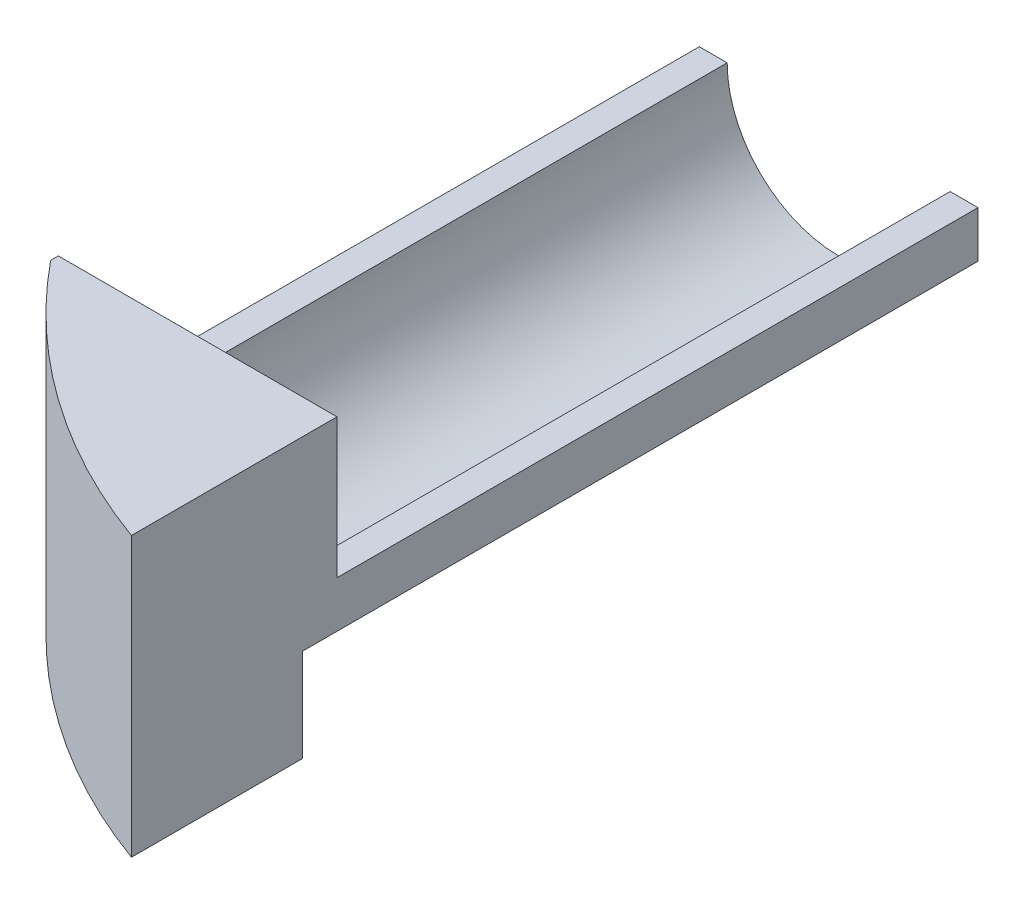
ISO-10303-21;
HEADER;
FILE_DESCRIPTION(('STEP AP214'),'2;1');
FILE_NAME('part.step','',(''),(''),'','','');
FILE_SCHEMA(('AUTOMOTIVE_DESIGN { 1 0 10303 214 1 1 1 1 }'));
ENDSEC;
DATA;
#1=APPLICATION_CONTEXT('core data for automotive mechanical design processes');
#2=APPLICATION_PROTOCOL_DEFINITION('international standard','automotive_design',2000,#1);
#3=PRODUCT_CONTEXT('',#1,'mechanical');
#4=PRODUCT('Part','Part','',(#3));
#5=PRODUCT_RELATED_PRODUCT_CATEGORY('part','',(#4));
#6=PRODUCT_DEFINITION_FORMATION('','',#4);
#7=PRODUCT_DEFINITION_CONTEXT('part definition',#1,'design');
#8=PRODUCT_DEFINITION('design','',#6,#7);
#9=PRODUCT_DEFINITION_SHAPE('','',#8);
#10=(LENGTH_UNIT() NAMED_UNIT(*) SI_UNIT(.MILLI.,.METRE.));
#11=(NAMED_UNIT(*) PLANE_ANGLE_UNIT() SI_UNIT($,.RADIAN.));
#12=(NAMED_UNIT(*) SI_UNIT($,.STERADIAN.) SOLID_ANGLE_UNIT());
#13=UNCERTAINTY_MEASURE_WITH_UNIT(LENGTH_MEASURE(1.E-05),#10,'distance_accuracy_value','');
#14=(GEOMETRIC_REPRESENTATION_CONTEXT(3) GLOBAL_UNCERTAINTY_ASSIGNED_CONTEXT((#13)) GLOBAL_UNIT_ASSIGNED_CONTEXT((#10,
#11,#12)) REPRESENTATION_CONTEXT('',''));
#15=CARTESIAN_POINT('',(0.,0.,0.));
#16=DIRECTION('',(0.,0.,1.));
#17=DIRECTION('',(1.,0.,0.));
#18=AXIS2_PLACEMENT_3D('',#15,#16,#17);
#19=CARTESIAN_POINT('',(-30.,30.,100.));
#20=DIRECTION('',(0.,-1.,0.));
#21=DIRECTION('',(0.,0.,-1.));
#22=AXIS2_PLACEMENT_3D('',#19,#20,#21);
#23=PLANE('',#22);
#24=DIRECTION('',(1.,0.,0.));
#25=VECTOR('',#24,1.);
#26=CARTESIAN_POINT('',(0.,30.,69.));
#27=LINE('',#26,#25);
#28=CARTESIAN_POINT('',(-30.,30.,69.));
#29=VERTEX_POINT('',#28);
#30=CARTESIAN_POINT('',(0.,30.,69.));
#31=VERTEX_POINT('',#30);
#32=EDGE_CURVE('E151',#29,#31,#27,.T.);
#33=ORIENTED_EDGE('',*,*,#32,.F.);
#34=DIRECTION('',(0.,0.,-1.));
#35=VECTOR('',#34,1.);
#36=CARTESIAN_POINT('',(-30.,30.,100.));
#37=LINE('',#36,#35);
#38=CARTESIAN_POINT('',(-30.,30.,69.8246485929605));
#39=VERTEX_POINT('',#38);
#40=EDGE_CURVE('E48',#39,#29,#37,.T.);
#41=ORIENTED_EDGE('',*,*,#40,.F.);
#42=CARTESIAN_POINT('',(23.5,30.,26.25));
#43=DIRECTION('',(0.,-1.,0.));
#44=DIRECTION('',(1.,0.,0.));
#45=AXIS2_PLACEMENT_3D('',#42,#43,#44);
#46=CIRCLE('',#45,69.);
#47=CARTESIAN_POINT('',(0.,30.,91.1248795759961));
#48=VERTEX_POINT('',#47);
#49=EDGE_CURVE('E174',#48,#39,#46,.T.);
#50=ORIENTED_EDGE('',*,*,#49,.F.);
#51=DIRECTION('',(0.,0.,-1.));
#52=VECTOR('',#51,1.);
#53=CARTESIAN_POINT('',(0.,30.,100.));
#54=LINE('',#53,#52);
#55=EDGE_CURVE('E12',#48,#31,#54,.T.);
#56=ORIENTED_EDGE('',*,*,#55,.T.);
#57=EDGE_LOOP('',(#33,#41,#50,#56));
#58=FACE_BOUND('',#57,.T.);
#59=ADVANCED_FACE('F40',(#58),#23,.F.);
#60=CARTESIAN_POINT('',(0.,30.,100.));
#61=DIRECTION('',(-1.,0.,0.));
#62=DIRECTION('',(0.,-1.,0.));
#63=AXIS2_PLACEMENT_3D('',#60,#61,#62);
#64=PLANE('',#63);
#65=DIRECTION('',(0.,-1.,0.));
#66=VECTOR('',#65,1.);
#67=CARTESIAN_POINT('',(0.,0.,72.7));
#68=LINE('',#67,#66);
#69=CARTESIAN_POINT('',(0.,10.,72.7));
#70=VERTEX_POINT('',#69);
#71=CARTESIAN_POINT('',(0.,0.,72.7));
#72=VERTEX_POINT('',#71);
#73=EDGE_CURVE('E122',#70,#72,#68,.T.);
#74=ORIENTED_EDGE('',*,*,#73,.F.);
#75=DIRECTION('',(0.,0.,-1.));
#76=VECTOR('',#75,1.);
#77=CARTESIAN_POINT('',(0.,10.,72.7));
#78=LINE('',#77,#76);
#79=CARTESIAN_POINT('',(0.,10.,0.));
#80=VERTEX_POINT('',#79);
#81=EDGE_CURVE('E119',#70,#80,#78,.T.);
#82=ORIENTED_EDGE('',*,*,#81,.T.);
#83=DIRECTION('',(0.,1.,0.));
#84=VECTOR('',#83,1.);
#85=CARTESIAN_POINT('',(0.,30.,0.));
#86=LINE('',#85,#84);
#87=CARTESIAN_POINT('',(0.,15.,0.));
#88=VERTEX_POINT('',#87);
#89=EDGE_CURVE('E182',#80,#88,#86,.T.);
#90=ORIENTED_EDGE('',*,*,#89,.T.);
#91=DIRECTION('',(0.,0.,-1.));
#92=VECTOR('',#91,1.);
#93=CARTESIAN_POINT('',(0.,15.,69.));
#94=LINE('',#93,#92);
#95=CARTESIAN_POINT('',(0.,15.,69.));
#96=VERTEX_POINT('',#95);
#97=EDGE_CURVE('E167',#96,#88,#94,.T.);
#98=ORIENTED_EDGE('',*,*,#97,.F.);
#99=DIRECTION('',(0.,-1.,0.));
#100=VECTOR('',#99,1.);
#101=CARTESIAN_POINT('',(0.,15.,69.));
#102=LINE('',#101,#100);
#103=EDGE_CURVE('E153',#31,#96,#102,.T.);
#104=ORIENTED_EDGE('',*,*,#103,.F.);
#105=ORIENTED_EDGE('',*,*,#55,.F.);
#106=DIRECTION('',(0.,-1.,0.));
#107=VECTOR('',#106,1.);
#108=CARTESIAN_POINT('',(0.,30.,91.1248795759961));
#109=LINE('',#108,#107);
#110=CARTESIAN_POINT('',(0.,0.,91.1248795759961));
#111=VERTEX_POINT('',#110);
#112=EDGE_CURVE('E180',#111,#48,#109,.F.);
#113=ORIENTED_EDGE('',*,*,#112,.F.);
#114=DIRECTION('',(0.,0.,-1.));
#115=VECTOR('',#114,1.);
#116=CARTESIAN_POINT('',(0.,0.,100.));
#117=LINE('',#116,#115);
#118=EDGE_CURVE('E187',#111,#72,#117,.T.);
#119=ORIENTED_EDGE('',*,*,#118,.T.);
#120=EDGE_LOOP('',(#74,#82,#90,#98,#104,#105,#113,#119));
#121=FACE_BOUND('',#120,.T.);
#122=ADVANCED_FACE('F42',(#121),#64,.F.);
#123=CARTESIAN_POINT('',(-30.,0.,100.));
#124=DIRECTION('',(1.,0.,0.));
#125=DIRECTION('',(0.,0.,-1.));
#126=AXIS2_PLACEMENT_3D('',#123,#124,#125);
#127=PLANE('',#126);
#128=DIRECTION('',(0.,1.,0.));
#129=VECTOR('',#128,1.);
#130=CARTESIAN_POINT('',(-30.,30.,69.));
#131=LINE('',#130,#129);
#132=CARTESIAN_POINT('',(-30.,15.,69.));
#133=VERTEX_POINT('',#132);
#134=EDGE_CURVE('E149',#133,#29,#131,.T.);
#135=ORIENTED_EDGE('',*,*,#134,.F.);
#136=DIRECTION('',(0.,0.,-1.));
#137=VECTOR('',#136,1.);
#138=CARTESIAN_POINT('',(-30.,15.,69.));
#139=LINE('',#138,#137);
#140=CARTESIAN_POINT('',(-30.,15.,0.));
#141=VERTEX_POINT('',#140);
#142=EDGE_CURVE('E170',#133,#141,#139,.T.);
#143=ORIENTED_EDGE('',*,*,#142,.T.);
#144=DIRECTION('',(0.,-1.,0.));
#145=VECTOR('',#144,1.);
#146=CARTESIAN_POINT('',(-30.,0.,0.));
#147=LINE('',#146,#145);
#148=CARTESIAN_POINT('',(-30.,0.,0.));
#149=VERTEX_POINT('',#148);
#150=EDGE_CURVE('E184',#141,#149,#147,.T.);
#151=ORIENTED_EDGE('',*,*,#150,.T.);
#152=DIRECTION('',(0.,0.,-1.));
#153=VECTOR('',#152,1.);
#154=CARTESIAN_POINT('',(-30.,0.,100.));
#155=LINE('',#154,#153);
#156=CARTESIAN_POINT('',(-30.,0.,69.8246485929605));
#157=VERTEX_POINT('',#156);
#158=EDGE_CURVE('E189',#157,#149,#155,.T.);
#159=ORIENTED_EDGE('',*,*,#158,.F.);
#160=DIRECTION('',(0.,-1.,0.));
#161=VECTOR('',#160,1.);
#162=CARTESIAN_POINT('',(-30.,30.,69.8246485929605));
#163=LINE('',#162,#161);
#164=EDGE_CURVE('E176',#39,#157,#163,.T.);
#165=ORIENTED_EDGE('',*,*,#164,.F.);
#166=ORIENTED_EDGE('',*,*,#40,.T.);
#167=EDGE_LOOP('',(#135,#143,#151,#159,#165,#166));
#168=FACE_BOUND('',#167,.T.);
#169=ADVANCED_FACE('F195',(#168),#127,.F.);
#170=CARTESIAN_POINT('',(0.,0.,100.));
#171=DIRECTION('',(0.,1.,0.));
#172=DIRECTION('',(-1.,0.,0.));
#173=AXIS2_PLACEMENT_3D('',#170,#171,#172);
#174=PLANE('',#173);
#175=DIRECTION('',(1.,0.,0.));
#176=VECTOR('',#175,1.);
#177=CARTESIAN_POINT('',(0.,0.,0.));
#178=LINE('',#177,#176);
#179=CARTESIAN_POINT('',(-10.,0.,0.));
#180=VERTEX_POINT('',#179);
#181=EDGE_CURVE('E136',#149,#180,#178,.T.);
#182=ORIENTED_EDGE('',*,*,#181,.T.);
#183=DIRECTION('',(0.,0.,-1.));
#184=VECTOR('',#183,1.);
#185=CARTESIAN_POINT('',(-10.,0.,72.7));
#186=LINE('',#185,#184);
#187=CARTESIAN_POINT('',(-10.,0.,72.7));
#188=VERTEX_POINT('',#187);
#189=EDGE_CURVE('E55',#188,#180,#186,.T.);
#190=ORIENTED_EDGE('',*,*,#189,.F.);
#191=DIRECTION('',(-1.,0.,0.));
#192=VECTOR('',#191,1.);
#193=CARTESIAN_POINT('',(-10.,0.,72.7));
#194=LINE('',#193,#192);
#195=EDGE_CURVE('E123',#72,#188,#194,.T.);
#196=ORIENTED_EDGE('',*,*,#195,.F.);
#197=ORIENTED_EDGE('',*,*,#118,.F.);
#198=CARTESIAN_POINT('',(23.5,0.,26.25));
#199=DIRECTION('',(0.,-1.,0.));
#200=DIRECTION('',(1.,0.,0.));
#201=AXIS2_PLACEMENT_3D('',#198,#199,#200);
#202=CIRCLE('',#201,69.);
#203=EDGE_CURVE('E166',#111,#157,#202,.T.);
#204=ORIENTED_EDGE('',*,*,#203,.T.);
#205=ORIENTED_EDGE('',*,*,#158,.T.);
#206=EDGE_LOOP('',(#182,#190,#196,#197,#204,#205));
#207=FACE_BOUND('',#206,.T.);
#208=ADVANCED_FACE('F133',(#207),#174,.F.);
#209=CARTESIAN_POINT('',(0.,0.,0.));
#210=DIRECTION('',(0.,0.,-1.));
#211=DIRECTION('',(-1.,0.,0.));
#212=AXIS2_PLACEMENT_3D('',#209,#210,#211);
#213=PLANE('',#212);
#214=DIRECTION('',(0.707106781186547,0.707106781186548,0.));
#215=VECTOR('',#214,1.);
#216=CARTESIAN_POINT('',(0.,10.,0.));
#217=LINE('',#216,#215);
#218=EDGE_CURVE('E130',#180,#80,#217,.T.);
#219=ORIENTED_EDGE('',*,*,#218,.F.);
#220=ORIENTED_EDGE('',*,*,#181,.F.);
#221=ORIENTED_EDGE('',*,*,#150,.F.);
#222=DIRECTION('',(-1.,0.,0.));
#223=VECTOR('',#222,1.);
#224=CARTESIAN_POINT('',(-30.,15.,0.));
#225=LINE('',#224,#223);
#226=CARTESIAN_POINT('',(-27.,15.,0.));
#227=VERTEX_POINT('',#226);
#228=EDGE_CURVE('E160',#227,#141,#225,.T.);
#229=ORIENTED_EDGE('',*,*,#228,.F.);
#230=CARTESIAN_POINT('',(-15.,15.,0.));
#231=DIRECTION('',(0.,0.,-1.));
#232=DIRECTION('',(-1.,0.,0.));
#233=AXIS2_PLACEMENT_3D('',#230,#231,#232);
#234=CIRCLE('',#233,12.);
#235=CARTESIAN_POINT('',(-3.,15.,0.));
#236=VERTEX_POINT('',#235);
#237=EDGE_CURVE('E63',#236,#227,#234,.T.);
#238=ORIENTED_EDGE('',*,*,#237,.F.);
#239=DIRECTION('',(-1.,0.,0.));
#240=VECTOR('',#239,1.);
#241=CARTESIAN_POINT('',(-3.,15.,0.));
#242=LINE('',#241,#240);
#243=EDGE_CURVE('E146',#88,#236,#242,.T.);
#244=ORIENTED_EDGE('',*,*,#243,.F.);
#245=ORIENTED_EDGE('',*,*,#89,.F.);
#246=EDGE_LOOP('',(#219,#220,#221,#229,#238,#244,#245));
#247=FACE_BOUND('',#246,.T.);
#248=ADVANCED_FACE('F213',(#247),#213,.T.);
#249=CARTESIAN_POINT('',(23.5,30.,26.25));
#250=DIRECTION('',(0.,-1.,0.));
#251=DIRECTION('',(1.,0.,0.));
#252=AXIS2_PLACEMENT_3D('',#249,#250,#251);
#253=CYLINDRICAL_SURFACE('',#252,69.);
#254=ORIENTED_EDGE('',*,*,#112,.T.);
#255=ORIENTED_EDGE('',*,*,#49,.T.);
#256=ORIENTED_EDGE('',*,*,#164,.T.);
#257=ORIENTED_EDGE('',*,*,#203,.F.);
#258=EDGE_LOOP('',(#254,#255,#256,#257));
#259=FACE_BOUND('',#258,.T.);
#260=ADVANCED_FACE('F220',(#259),#253,.T.);
#261=CARTESIAN_POINT('',(-15.,15.,69.));
#262=DIRECTION('',(0.,0.,-1.));
#263=DIRECTION('',(-1.,0.,0.));
#264=AXIS2_PLACEMENT_3D('',#261,#262,#263);
#265=CYLINDRICAL_SURFACE('',#264,12.);
#266=ORIENTED_EDGE('',*,*,#237,.T.);
#267=DIRECTION('',(0.,0.,-1.));
#268=VECTOR('',#267,1.);
#269=CARTESIAN_POINT('',(-27.,15.,69.));
#270=LINE('',#269,#268);
#271=CARTESIAN_POINT('',(-27.,15.,69.));
#272=VERTEX_POINT('',#271);
#273=EDGE_CURVE('E158',#272,#227,#270,.T.);
#274=ORIENTED_EDGE('',*,*,#273,.F.);
#275=CARTESIAN_POINT('',(-15.,15.,69.));
#276=DIRECTION('',(0.,0.,-1.));
#277=DIRECTION('',(-1.,0.,0.));
#278=AXIS2_PLACEMENT_3D('',#275,#276,#277);
#279=CIRCLE('',#278,12.);
#280=CARTESIAN_POINT('',(-3.,15.,69.));
#281=VERTEX_POINT('',#280);
#282=EDGE_CURVE('E142',#281,#272,#279,.T.);
#283=ORIENTED_EDGE('',*,*,#282,.F.);
#284=DIRECTION('',(0.,0.,-1.));
#285=VECTOR('',#284,1.);
#286=CARTESIAN_POINT('',(-3.,15.,69.));
#287=LINE('',#286,#285);
#288=EDGE_CURVE('E164',#281,#236,#287,.T.);
#289=ORIENTED_EDGE('',*,*,#288,.T.);
#290=EDGE_LOOP('',(#266,#274,#283,#289));
#291=FACE_BOUND('',#290,.T.);
#292=ADVANCED_FACE('F222',(#291),#265,.F.);
#293=CARTESIAN_POINT('',(-3.,15.,69.));
#294=DIRECTION('',(0.,-1.,0.));
#295=DIRECTION('',(1.,0.,0.));
#296=AXIS2_PLACEMENT_3D('',#293,#294,#295);
#297=PLANE('',#296);
#298=ORIENTED_EDGE('',*,*,#243,.T.);
#299=ORIENTED_EDGE('',*,*,#288,.F.);
#300=DIRECTION('',(-1.,0.,0.));
#301=VECTOR('',#300,1.);
#302=CARTESIAN_POINT('',(-3.,15.,69.));
#303=LINE('',#302,#301);
#304=EDGE_CURVE('E155',#96,#281,#303,.T.);
#305=ORIENTED_EDGE('',*,*,#304,.F.);
#306=ORIENTED_EDGE('',*,*,#97,.T.);
#307=EDGE_LOOP('',(#298,#299,#305,#306));
#308=FACE_BOUND('',#307,.T.);
#309=ADVANCED_FACE('F211',(#308),#297,.F.);
#310=CARTESIAN_POINT('',(-30.,15.,69.));
#311=DIRECTION('',(0.,-1.,0.));
#312=DIRECTION('',(0.,0.,-1.));
#313=AXIS2_PLACEMENT_3D('',#310,#311,#312);
#314=PLANE('',#313);
#315=ORIENTED_EDGE('',*,*,#228,.T.);
#316=ORIENTED_EDGE('',*,*,#142,.F.);
#317=DIRECTION('',(-1.,0.,0.));
#318=VECTOR('',#317,1.);
#319=CARTESIAN_POINT('',(-30.,15.,69.));
#320=LINE('',#319,#318);
#321=EDGE_CURVE('E145',#272,#133,#320,.T.);
#322=ORIENTED_EDGE('',*,*,#321,.F.);
#323=ORIENTED_EDGE('',*,*,#273,.T.);
#324=EDGE_LOOP('',(#315,#316,#322,#323));
#325=FACE_BOUND('',#324,.T.);
#326=ADVANCED_FACE('F217',(#325),#314,.F.);
#327=CARTESIAN_POINT('',(-15.,15.,69.));
#328=DIRECTION('',(0.,0.,-1.));
#329=DIRECTION('',(-1.,0.,0.));
#330=AXIS2_PLACEMENT_3D('',#327,#328,#329);
#331=PLANE('',#330);
#332=ORIENTED_EDGE('',*,*,#282,.T.);
#333=ORIENTED_EDGE('',*,*,#321,.T.);
#334=ORIENTED_EDGE('',*,*,#134,.T.);
#335=ORIENTED_EDGE('',*,*,#32,.T.);
#336=ORIENTED_EDGE('',*,*,#103,.T.);
#337=ORIENTED_EDGE('',*,*,#304,.T.);
#338=EDGE_LOOP('',(#332,#333,#334,#335,#336,#337));
#339=FACE_BOUND('',#338,.T.);
#340=ADVANCED_FACE('F203',(#339),#331,.T.);
#341=CARTESIAN_POINT('',(0.,10.,72.7));
#342=DIRECTION('',(-0.707106781186548,0.707106781186547,0.));
#343=DIRECTION('',(-0.707106781186547,-0.707106781186548,0.));
#344=AXIS2_PLACEMENT_3D('',#341,#342,#343);
#345=PLANE('',#344);
#346=ORIENTED_EDGE('',*,*,#218,.T.);
#347=ORIENTED_EDGE('',*,*,#81,.F.);
#348=DIRECTION('',(0.707106781186547,0.707106781186548,0.));
#349=VECTOR('',#348,1.);
#350=CARTESIAN_POINT('',(0.,10.,72.7));
#351=LINE('',#350,#349);
#352=EDGE_CURVE('E115',#188,#70,#351,.T.);
#353=ORIENTED_EDGE('',*,*,#352,.F.);
#354=ORIENTED_EDGE('',*,*,#189,.T.);
#355=EDGE_LOOP('',(#346,#347,#353,#354));
#356=FACE_BOUND('',#355,.T.);
#357=ADVANCED_FACE('F117',(#356),#345,.F.);
#358=CARTESIAN_POINT('',(0.,0.,72.7));
#359=DIRECTION('',(0.,0.,1.));
#360=DIRECTION('',(1.,0.,0.));
#361=AXIS2_PLACEMENT_3D('',#358,#359,#360);
#362=PLANE('',#361);
#363=ORIENTED_EDGE('',*,*,#195,.T.);
#364=ORIENTED_EDGE('',*,*,#352,.T.);
#365=ORIENTED_EDGE('',*,*,#73,.T.);
#366=EDGE_LOOP('',(#363,#364,#365));
#367=FACE_BOUND('',#366,.T.);
#368=ADVANCED_FACE('F126',(#367),#362,.F.);
#369=CLOSED_SHELL('',(#59,#122,#169,#208,#248,#260,#292,#309,#326,#340,#357,#368));
#370=MANIFOLD_SOLID_BREP('B2',#369);
#371=ADVANCED_BREP_SHAPE_REPRESENTATION('',(#18,#370),#14);
#372=SHAPE_DEFINITION_REPRESENTATION(#9,#371);
ENDSEC;
END-ISO-10303-21;
